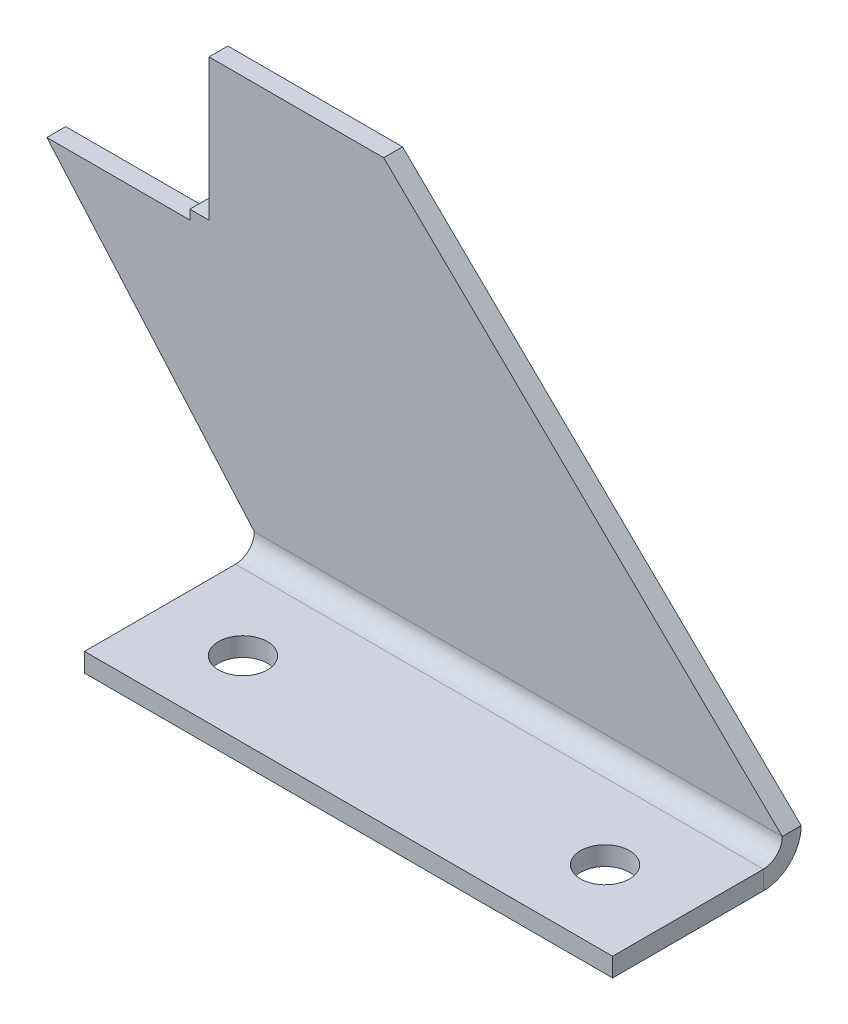
ISO-10303-21;
HEADER;
FILE_DESCRIPTION(('STEP AP214'),'2;1');
FILE_NAME('part.step','',(''),(''),'','','');
FILE_SCHEMA(('AUTOMOTIVE_DESIGN { 1 0 10303 214 1 1 1 1 }'));
ENDSEC;
DATA;
#1=APPLICATION_CONTEXT('core data for automotive mechanical design processes');
#2=APPLICATION_PROTOCOL_DEFINITION('international standard','automotive_design',2000,#1);
#3=PRODUCT_CONTEXT('',#1,'mechanical');
#4=PRODUCT('Part','Part','',(#3));
#5=PRODUCT_RELATED_PRODUCT_CATEGORY('part','',(#4));
#6=PRODUCT_DEFINITION_FORMATION('','',#4);
#7=PRODUCT_DEFINITION_CONTEXT('part definition',#1,'design');
#8=PRODUCT_DEFINITION('design','',#6,#7);
#9=PRODUCT_DEFINITION_SHAPE('','',#8);
#10=(LENGTH_UNIT() NAMED_UNIT(*) SI_UNIT(.MILLI.,.METRE.));
#11=(NAMED_UNIT(*) PLANE_ANGLE_UNIT() SI_UNIT($,.RADIAN.));
#12=(NAMED_UNIT(*) SI_UNIT($,.STERADIAN.) SOLID_ANGLE_UNIT());
#13=UNCERTAINTY_MEASURE_WITH_UNIT(LENGTH_MEASURE(1.E-05),#10,'distance_accuracy_value','');
#14=(GEOMETRIC_REPRESENTATION_CONTEXT(3) GLOBAL_UNCERTAINTY_ASSIGNED_CONTEXT((#13)) GLOBAL_UNIT_ASSIGNED_CONTEXT((#10,
#11,#12)) REPRESENTATION_CONTEXT('',''));
#15=CARTESIAN_POINT('',(0.,0.,0.));
#16=DIRECTION('',(0.,0.,1.));
#17=DIRECTION('',(1.,0.,0.));
#18=AXIS2_PLACEMENT_3D('',#15,#16,#17);
#19=CARTESIAN_POINT('',(-35.4637681159422,-31.5507246376835,-5.));
#20=DIRECTION('',(-1.,0.,0.));
#21=DIRECTION('',(0.,-1.,0.));
#22=AXIS2_PLACEMENT_3D('',#19,#20,#21);
#23=PLANE('',#22);
#24=DIRECTION('',(0.,-1.,0.));
#25=VECTOR('',#24,1.);
#26=CARTESIAN_POINT('',(-35.4637681159422,-31.5507246376835,0.));
#27=LINE('',#26,#25);
#28=CARTESIAN_POINT('',(-35.4637681159422,-29.0507246376835,0.));
#29=VERTEX_POINT('',#28);
#30=CARTESIAN_POINT('',(-35.4637681159422,-31.5507246376835,0.));
#31=VERTEX_POINT('',#30);
#32=EDGE_CURVE('E157',#29,#31,#27,.T.);
#33=ORIENTED_EDGE('',*,*,#32,.F.);
#34=DIRECTION('',(0.,0.,1.));
#35=VECTOR('',#34,1.);
#36=CARTESIAN_POINT('',(-35.4637681159422,-29.0507246376835,-5.));
#37=LINE('',#36,#35);
#38=CARTESIAN_POINT('',(-35.4637681159422,-29.0507246376835,-5.));
#39=VERTEX_POINT('',#38);
#40=EDGE_CURVE('E13',#39,#29,#37,.T.);
#41=ORIENTED_EDGE('',*,*,#40,.F.);
#42=DIRECTION('',(0.,-1.,0.));
#43=VECTOR('',#42,1.);
#44=CARTESIAN_POINT('',(-35.4637681159422,-31.5507246376835,-5.));
#45=LINE('',#44,#43);
#46=CARTESIAN_POINT('',(-35.4637681159422,-31.5507246376835,-5.));
#47=VERTEX_POINT('',#46);
#48=EDGE_CURVE('E178',#39,#47,#45,.T.);
#49=ORIENTED_EDGE('',*,*,#48,.T.);
#50=DIRECTION('',(0.,0.,1.));
#51=VECTOR('',#50,1.);
#52=CARTESIAN_POINT('',(-35.4637681159422,-31.5507246376835,-5.));
#53=LINE('',#52,#51);
#54=EDGE_CURVE('E62',#47,#31,#53,.T.);
#55=ORIENTED_EDGE('',*,*,#54,.T.);
#56=EDGE_LOOP('',(#33,#41,#49,#55));
#57=FACE_BOUND('',#56,.T.);
#58=ADVANCED_FACE('F59',(#57),#23,.T.);
#59=CARTESIAN_POINT('',(-30.3797448200958,-29.0507246376835,-5.));
#60=DIRECTION('',(0.,1.,0.));
#61=DIRECTION('',(-1.,0.,0.));
#62=AXIS2_PLACEMENT_3D('',#59,#60,#61);
#63=PLANE('',#62);
#64=DIRECTION('',(-1.,0.,0.));
#65=VECTOR('',#64,1.);
#66=CARTESIAN_POINT('',(-30.3797448200958,-29.0507246376835,0.));
#67=LINE('',#66,#65);
#68=CARTESIAN_POINT('',(-30.3797448200958,-29.0507246376835,0.));
#69=VERTEX_POINT('',#68);
#70=EDGE_CURVE('E176',#69,#29,#67,.T.);
#71=ORIENTED_EDGE('',*,*,#70,.F.);
#72=DIRECTION('',(0.,0.,1.));
#73=VECTOR('',#72,1.);
#74=CARTESIAN_POINT('',(-30.3797448200958,-29.0507246376835,-5.));
#75=LINE('',#74,#73);
#76=CARTESIAN_POINT('',(-30.3797448200958,-29.0507246376835,-5.));
#77=VERTEX_POINT('',#76);
#78=EDGE_CURVE('E68',#77,#69,#75,.T.);
#79=ORIENTED_EDGE('',*,*,#78,.F.);
#80=DIRECTION('',(-1.,0.,0.));
#81=VECTOR('',#80,1.);
#82=CARTESIAN_POINT('',(-30.3797448200958,-29.0507246376835,-5.));
#83=LINE('',#82,#81);
#84=EDGE_CURVE('E147',#77,#39,#83,.T.);
#85=ORIENTED_EDGE('',*,*,#84,.T.);
#86=ORIENTED_EDGE('',*,*,#40,.T.);
#87=EDGE_LOOP('',(#71,#79,#85,#86));
#88=FACE_BOUND('',#87,.T.);
#89=ADVANCED_FACE('F191',(#88),#63,.T.);
#90=CARTESIAN_POINT('',(-30.3797448200958,-29.0507246376835,-5.));
#91=DIRECTION('',(-1.,0.,0.));
#92=DIRECTION('',(0.,-1.,0.));
#93=AXIS2_PLACEMENT_3D('',#90,#91,#92);
#94=PLANE('',#93);
#95=DIRECTION('',(0.,-1.,0.));
#96=VECTOR('',#95,1.);
#97=CARTESIAN_POINT('',(-30.3797448200958,-29.0507246376835,0.));
#98=LINE('',#97,#96);
#99=CARTESIAN_POINT('',(-30.3797448200958,8.44927536231646,0.));
#100=VERTEX_POINT('',#99);
#101=EDGE_CURVE('E134',#100,#69,#98,.T.);
#102=ORIENTED_EDGE('',*,*,#101,.F.);
#103=DIRECTION('',(0.,0.,1.));
#104=VECTOR('',#103,1.);
#105=CARTESIAN_POINT('',(-30.3797448200958,8.44927536231646,-5.));
#106=LINE('',#105,#104);
#107=CARTESIAN_POINT('',(-30.3797448200958,8.44927536231646,-5.));
#108=VERTEX_POINT('',#107);
#109=EDGE_CURVE('E129',#108,#100,#106,.T.);
#110=ORIENTED_EDGE('',*,*,#109,.F.);
#111=DIRECTION('',(0.,-1.,0.));
#112=VECTOR('',#111,1.);
#113=CARTESIAN_POINT('',(-30.3797448200958,-29.0507246376835,-5.));
#114=LINE('',#113,#112);
#115=EDGE_CURVE('E132',#108,#77,#114,.T.);
#116=ORIENTED_EDGE('',*,*,#115,.T.);
#117=ORIENTED_EDGE('',*,*,#78,.T.);
#118=EDGE_LOOP('',(#102,#110,#116,#117));
#119=FACE_BOUND('',#118,.T.);
#120=ADVANCED_FACE('F131',(#119),#94,.T.);
#121=CARTESIAN_POINT('',(-30.3797448200958,8.44927536231646,-5.));
#122=DIRECTION('',(0.,1.,0.));
#123=DIRECTION('',(-1.,0.,0.));
#124=AXIS2_PLACEMENT_3D('',#121,#122,#123);
#125=PLANE('',#124);
#126=DIRECTION('',(-1.,0.,0.));
#127=VECTOR('',#126,1.);
#128=CARTESIAN_POINT('',(-30.3797448200958,8.44927536231646,0.));
#129=LINE('',#128,#127);
#130=CARTESIAN_POINT('',(15.9257985596365,8.44927536231649,0.));
#131=VERTEX_POINT('',#130);
#132=EDGE_CURVE('E173',#131,#100,#129,.T.);
#133=ORIENTED_EDGE('',*,*,#132,.F.);
#134=DIRECTION('',(0.,0.,1.));
#135=VECTOR('',#134,1.);
#136=CARTESIAN_POINT('',(15.9257985596365,8.44927536231649,-5.));
#137=LINE('',#136,#135);
#138=CARTESIAN_POINT('',(15.9257985596365,8.44927536231649,-5.));
#139=VERTEX_POINT('',#138);
#140=EDGE_CURVE('E139',#139,#131,#137,.T.);
#141=ORIENTED_EDGE('',*,*,#140,.F.);
#142=DIRECTION('',(-1.,0.,0.));
#143=VECTOR('',#142,1.);
#144=CARTESIAN_POINT('',(-30.3797448200958,8.44927536231646,-5.));
#145=LINE('',#144,#143);
#146=EDGE_CURVE('E145',#139,#108,#145,.T.);
#147=ORIENTED_EDGE('',*,*,#146,.T.);
#148=ORIENTED_EDGE('',*,*,#109,.T.);
#149=EDGE_LOOP('',(#133,#141,#147,#148));
#150=FACE_BOUND('',#149,.T.);
#151=ADVANCED_FACE('F149',(#150),#125,.T.);
#152=CARTESIAN_POINT('',(15.9257985596365,8.44927536231649,-5.));
#153=DIRECTION('',(0.697919149971632,0.716176556515832,0.));
#154=DIRECTION('',(-0.716176556515832,0.697919149971632,0.));
#155=AXIS2_PLACEMENT_3D('',#152,#153,#154);
#156=PLANE('',#155);
#157=DIRECTION('',(-0.716176556515832,0.697919149971632,0.));
#158=VECTOR('',#157,1.);
#159=CARTESIAN_POINT('',(15.9257985596365,8.44927536231649,0.));
#160=LINE('',#159,#158);
#161=CARTESIAN_POINT('',(121.620255179904,-94.5507246376835,0.));
#162=VERTEX_POINT('',#161);
#163=EDGE_CURVE('E170',#162,#131,#160,.T.);
#164=ORIENTED_EDGE('',*,*,#163,.F.);
#165=DIRECTION('',(0.,0.,1.));
#166=VECTOR('',#165,1.);
#167=CARTESIAN_POINT('',(121.620255179904,-94.5507246376835,-5.));
#168=LINE('',#167,#166);
#169=CARTESIAN_POINT('',(121.620255179904,-94.5507246376835,-4.99999999999998));
#170=VERTEX_POINT('',#169);
#171=EDGE_CURVE('E182',#170,#162,#168,.T.);
#172=ORIENTED_EDGE('',*,*,#171,.F.);
#173=DIRECTION('',(-0.716176556515832,0.697919149971632,0.));
#174=VECTOR('',#173,1.);
#175=CARTESIAN_POINT('',(15.9257985596365,8.44927536231649,-5.));
#176=LINE('',#175,#174);
#177=EDGE_CURVE('E150',#170,#139,#176,.T.);
#178=ORIENTED_EDGE('',*,*,#177,.T.);
#179=ORIENTED_EDGE('',*,*,#140,.T.);
#180=EDGE_LOOP('',(#164,#172,#178,#179));
#181=FACE_BOUND('',#180,.T.);
#182=ADVANCED_FACE('F204',(#181),#156,.T.);
#183=CARTESIAN_POINT('',(-73.3797448200958,-31.5507246376835,-5.));
#184=DIRECTION('',(-0.753316943211021,-0.657657648835018,0.));
#185=DIRECTION('',(0.657657648835018,-0.753316943211021,0.));
#186=AXIS2_PLACEMENT_3D('',#183,#184,#185);
#187=PLANE('',#186);
#188=DIRECTION('',(0.657657648835018,-0.753316943211021,0.));
#189=VECTOR('',#188,1.);
#190=CARTESIAN_POINT('',(-73.3797448200958,-31.5507246376835,0.));
#191=LINE('',#190,#189);
#192=CARTESIAN_POINT('',(-73.3797448200958,-31.5507246376835,0.));
#193=VERTEX_POINT('',#192);
#194=CARTESIAN_POINT('',(-18.3797448200958,-94.5507246376835,0.));
#195=VERTEX_POINT('',#194);
#196=EDGE_CURVE('E164',#193,#195,#191,.T.);
#197=ORIENTED_EDGE('',*,*,#196,.F.);
#198=DIRECTION('',(0.,0.,1.));
#199=VECTOR('',#198,1.);
#200=CARTESIAN_POINT('',(-73.3797448200958,-31.5507246376835,-5.));
#201=LINE('',#200,#199);
#202=CARTESIAN_POINT('',(-73.3797448200958,-31.5507246376835,-5.));
#203=VERTEX_POINT('',#202);
#204=EDGE_CURVE('E186',#203,#193,#201,.T.);
#205=ORIENTED_EDGE('',*,*,#204,.F.);
#206=DIRECTION('',(0.657657648835018,-0.753316943211021,0.));
#207=VECTOR('',#206,1.);
#208=CARTESIAN_POINT('',(-73.3797448200958,-31.5507246376835,-5.));
#209=LINE('',#208,#207);
#210=CARTESIAN_POINT('',(-18.3797448200958,-94.5507246376835,-5.));
#211=VERTEX_POINT('',#210);
#212=EDGE_CURVE('E327',#203,#211,#209,.T.);
#213=ORIENTED_EDGE('',*,*,#212,.T.);
#214=DIRECTION('',(0.,0.,1.));
#215=VECTOR('',#214,1.);
#216=CARTESIAN_POINT('',(-18.3797448200958,-94.5507246376835,-5.));
#217=LINE('',#216,#215);
#218=EDGE_CURVE('E185',#211,#195,#217,.T.);
#219=ORIENTED_EDGE('',*,*,#218,.T.);
#220=EDGE_LOOP('',(#197,#205,#213,#219));
#221=FACE_BOUND('',#220,.T.);
#222=ADVANCED_FACE('F207',(#221),#187,.T.);
#223=CARTESIAN_POINT('',(-35.4637681159422,-31.5507246376835,-5.));
#224=DIRECTION('',(0.,1.,0.));
#225=DIRECTION('',(0.,0.,1.));
#226=AXIS2_PLACEMENT_3D('',#223,#224,#225);
#227=PLANE('',#226);
#228=DIRECTION('',(-1.,0.,0.));
#229=VECTOR('',#228,1.);
#230=CARTESIAN_POINT('',(-35.4637681159422,-31.5507246376835,0.));
#231=LINE('',#230,#229);
#232=EDGE_CURVE('E160',#31,#193,#231,.T.);
#233=ORIENTED_EDGE('',*,*,#232,.F.);
#234=ORIENTED_EDGE('',*,*,#54,.F.);
#235=DIRECTION('',(-1.,0.,0.));
#236=VECTOR('',#235,1.);
#237=CARTESIAN_POINT('',(-35.4637681159422,-31.5507246376835,-5.));
#238=LINE('',#237,#236);
#239=EDGE_CURVE('E325',#47,#203,#238,.T.);
#240=ORIENTED_EDGE('',*,*,#239,.T.);
#241=ORIENTED_EDGE('',*,*,#204,.T.);
#242=EDGE_LOOP('',(#233,#234,#240,#241));
#243=FACE_BOUND('',#242,.T.);
#244=ADVANCED_FACE('F188',(#243),#227,.T.);
#245=CARTESIAN_POINT('',(0.,0.,-5.));
#246=DIRECTION('',(0.,0.,1.));
#247=DIRECTION('',(1.,0.,0.));
#248=AXIS2_PLACEMENT_3D('',#245,#246,#247);
#249=PLANE('',#248);
#250=ORIENTED_EDGE('',*,*,#48,.F.);
#251=ORIENTED_EDGE('',*,*,#84,.F.);
#252=ORIENTED_EDGE('',*,*,#115,.F.);
#253=ORIENTED_EDGE('',*,*,#146,.F.);
#254=ORIENTED_EDGE('',*,*,#177,.F.);
#255=DIRECTION('',(1.,0.,0.));
#256=VECTOR('',#255,1.);
#257=CARTESIAN_POINT('',(121.620255179904,-94.5507246376835,-5.));
#258=LINE('',#257,#256);
#259=EDGE_CURVE('E152',#211,#170,#258,.T.);
#260=ORIENTED_EDGE('',*,*,#259,.F.);
#261=ORIENTED_EDGE('',*,*,#212,.F.);
#262=ORIENTED_EDGE('',*,*,#239,.F.);
#263=EDGE_LOOP('',(#250,#251,#252,#253,#254,#260,#261,#262));
#264=FACE_BOUND('',#263,.T.);
#265=ADVANCED_FACE('F143',(#264),#249,.F.);
#266=CARTESIAN_POINT('',(0.,0.,0.));
#267=DIRECTION('',(0.,0.,1.));
#268=DIRECTION('',(1.,0.,0.));
#269=AXIS2_PLACEMENT_3D('',#266,#267,#268);
#270=PLANE('',#269);
#271=ORIENTED_EDGE('',*,*,#32,.T.);
#272=ORIENTED_EDGE('',*,*,#232,.T.);
#273=ORIENTED_EDGE('',*,*,#196,.T.);
#274=DIRECTION('',(1.,0.,0.));
#275=VECTOR('',#274,1.);
#276=CARTESIAN_POINT('',(121.620255179904,-94.5507246376835,0.));
#277=LINE('',#276,#275);
#278=EDGE_CURVE('E167',#195,#162,#277,.T.);
#279=ORIENTED_EDGE('',*,*,#278,.T.);
#280=ORIENTED_EDGE('',*,*,#163,.T.);
#281=ORIENTED_EDGE('',*,*,#132,.T.);
#282=ORIENTED_EDGE('',*,*,#101,.T.);
#283=ORIENTED_EDGE('',*,*,#70,.T.);
#284=EDGE_LOOP('',(#271,#272,#273,#279,#280,#281,#282,#283));
#285=FACE_BOUND('',#284,.T.);
#286=ADVANCED_FACE('F190',(#285),#270,.T.);
#287=CARTESIAN_POINT('',(-18.3797448200958,-94.5507246376835,5.));
#288=DIRECTION('',(-1.,0.,0.));
#289=DIRECTION('',(0.,0.,1.));
#290=AXIS2_PLACEMENT_3D('',#287,#288,#289);
#291=PLANE('',#290);
#292=DIRECTION('',(0.,1.,0.));
#293=VECTOR('',#292,1.);
#294=CARTESIAN_POINT('',(-18.3797448200958,-104.550724637684,4.99999999999996));
#295=LINE('',#294,#293);
#296=CARTESIAN_POINT('',(-18.3797448200958,-99.5507246376835,4.99999999999998));
#297=VERTEX_POINT('',#296);
#298=CARTESIAN_POINT('',(-18.3797448200958,-104.550724637684,4.99999999999996));
#299=VERTEX_POINT('',#298);
#300=EDGE_CURVE('E271',#297,#299,#295,.F.);
#301=ORIENTED_EDGE('',*,*,#300,.F.);
#302=CARTESIAN_POINT('',(-18.3797448200958,-94.5507246376835,5.));
#303=DIRECTION('',(1.,0.,0.));
#304=DIRECTION('',(0.,0.,-1.));
#305=AXIS2_PLACEMENT_3D('',#302,#303,#304);
#306=CIRCLE('',#305,4.99999999999999);
#307=EDGE_CURVE('E319',#195,#297,#306,.F.);
#308=ORIENTED_EDGE('',*,*,#307,.F.);
#309=ORIENTED_EDGE('',*,*,#218,.F.);
#310=CARTESIAN_POINT('',(-18.3797448200958,-94.5507246376835,5.));
#311=DIRECTION('',(1.,0.,0.));
#312=DIRECTION('',(0.,0.,-1.));
#313=AXIS2_PLACEMENT_3D('',#310,#311,#312);
#314=CIRCLE('',#313,9.99999999999999);
#315=EDGE_CURVE('E161',#211,#299,#314,.F.);
#316=ORIENTED_EDGE('',*,*,#315,.T.);
#317=EDGE_LOOP('',(#301,#308,#309,#316));
#318=FACE_BOUND('',#317,.T.);
#319=ADVANCED_FACE('F218',(#318),#291,.T.);
#320=CARTESIAN_POINT('',(121.620255179904,-94.5507246376835,5.00000000000001));
#321=DIRECTION('',(-1.,0.,0.));
#322=DIRECTION('',(0.,0.,1.));
#323=AXIS2_PLACEMENT_3D('',#320,#321,#322);
#324=PLANE('',#323);
#325=CARTESIAN_POINT('',(121.620255179904,-94.5507246376835,5.00000000000001));
#326=DIRECTION('',(1.,0.,0.));
#327=DIRECTION('',(0.,0.,-1.));
#328=AXIS2_PLACEMENT_3D('',#325,#326,#327);
#329=CIRCLE('',#328,4.99999999999999);
#330=CARTESIAN_POINT('',(121.620255179904,-99.5507246376835,4.99999999999999));
#331=VERTEX_POINT('',#330);
#332=EDGE_CURVE('E284',#331,#162,#329,.T.);
#333=ORIENTED_EDGE('',*,*,#332,.F.);
#334=DIRECTION('',(0.,1.,0.));
#335=VECTOR('',#334,1.);
#336=CARTESIAN_POINT('',(121.620255179904,-99.5507246376835,4.99999999999999));
#337=LINE('',#336,#335);
#338=CARTESIAN_POINT('',(121.620255179904,-104.550724637684,4.99999999999997));
#339=VERTEX_POINT('',#338);
#340=EDGE_CURVE('E309',#331,#339,#337,.F.);
#341=ORIENTED_EDGE('',*,*,#340,.T.);
#342=CARTESIAN_POINT('',(121.620255179904,-94.5507246376835,5.00000000000001));
#343=DIRECTION('',(1.,0.,0.));
#344=DIRECTION('',(0.,0.,-1.));
#345=AXIS2_PLACEMENT_3D('',#342,#343,#344);
#346=CIRCLE('',#345,9.99999999999999);
#347=EDGE_CURVE('E316',#339,#170,#346,.T.);
#348=ORIENTED_EDGE('',*,*,#347,.T.);
#349=ORIENTED_EDGE('',*,*,#171,.T.);
#350=EDGE_LOOP('',(#333,#341,#348,#349));
#351=FACE_BOUND('',#350,.T.);
#352=ADVANCED_FACE('F220',(#351),#324,.F.);
#353=CARTESIAN_POINT('',(121.620255179904,-94.5507246376835,5.00000000000001));
#354=DIRECTION('',(1.,0.,0.));
#355=DIRECTION('',(0.,-1.,0.));
#356=AXIS2_PLACEMENT_3D('',#353,#354,#355);
#357=CYLINDRICAL_SURFACE('',#356,9.99999999999999);
#358=ORIENTED_EDGE('',*,*,#259,.T.);
#359=ORIENTED_EDGE('',*,*,#347,.F.);
#360=DIRECTION('',(1.,0.,0.));
#361=VECTOR('',#360,1.);
#362=CARTESIAN_POINT('',(-18.3797448200958,-104.550724637684,4.99999999999996));
#363=LINE('',#362,#361);
#364=EDGE_CURVE('E306',#339,#299,#363,.F.);
#365=ORIENTED_EDGE('',*,*,#364,.T.);
#366=ORIENTED_EDGE('',*,*,#315,.F.);
#367=EDGE_LOOP('',(#358,#359,#365,#366));
#368=FACE_BOUND('',#367,.T.);
#369=ADVANCED_FACE('F223',(#368),#357,.T.);
#370=CARTESIAN_POINT('',(121.620255179904,-94.5507246376835,5.00000000000001));
#371=DIRECTION('',(1.,0.,0.));
#372=DIRECTION('',(0.,-1.,0.));
#373=AXIS2_PLACEMENT_3D('',#370,#371,#372);
#374=CYLINDRICAL_SURFACE('',#373,4.99999999999999);
#375=ORIENTED_EDGE('',*,*,#278,.F.);
#376=ORIENTED_EDGE('',*,*,#307,.T.);
#377=DIRECTION('',(1.,0.,0.));
#378=VECTOR('',#377,1.);
#379=CARTESIAN_POINT('',(-18.3797448200958,-99.5507246376835,4.99999999999998));
#380=LINE('',#379,#378);
#381=EDGE_CURVE('E275',#297,#331,#380,.T.);
#382=ORIENTED_EDGE('',*,*,#381,.T.);
#383=ORIENTED_EDGE('',*,*,#332,.T.);
#384=EDGE_LOOP('',(#375,#376,#382,#383));
#385=FACE_BOUND('',#384,.T.);
#386=ADVANCED_FACE('F228',(#385),#374,.F.);
#387=CARTESIAN_POINT('',(-18.3797448200958,-104.550724637684,0.));
#388=DIRECTION('',(1.,0.,0.));
#389=DIRECTION('',(0.,1.,0.));
#390=AXIS2_PLACEMENT_3D('',#387,#388,#389);
#391=PLANE('',#390);
#392=ORIENTED_EDGE('',*,*,#300,.T.);
#393=DIRECTION('',(0.,0.,-1.));
#394=VECTOR('',#393,1.);
#395=CARTESIAN_POINT('',(-18.3797448200958,-104.550724637684,-3.38206380684561E-13));
#396=LINE('',#395,#394);
#397=CARTESIAN_POINT('',(-18.3797448200958,-104.550724637684,45.));
#398=VERTEX_POINT('',#397);
#399=EDGE_CURVE('E294',#398,#299,#396,.T.);
#400=ORIENTED_EDGE('',*,*,#399,.F.);
#401=DIRECTION('',(0.,1.,0.));
#402=VECTOR('',#401,1.);
#403=CARTESIAN_POINT('',(-18.3797448200958,-104.550724637684,45.));
#404=LINE('',#403,#402);
#405=CARTESIAN_POINT('',(-18.3797448200958,-99.5507246376837,45.));
#406=VERTEX_POINT('',#405);
#407=EDGE_CURVE('E285',#398,#406,#404,.T.);
#408=ORIENTED_EDGE('',*,*,#407,.T.);
#409=DIRECTION('',(0.,0.,1.));
#410=VECTOR('',#409,1.);
#411=CARTESIAN_POINT('',(-18.3797448200958,-99.5507246376835,0.));
#412=LINE('',#411,#410);
#413=EDGE_CURVE('E303',#406,#297,#412,.F.);
#414=ORIENTED_EDGE('',*,*,#413,.T.);
#415=EDGE_LOOP('',(#392,#400,#408,#414));
#416=FACE_BOUND('',#415,.T.);
#417=ADVANCED_FACE('F231',(#416),#391,.F.);
#418=CARTESIAN_POINT('',(121.620255179904,-104.550724637684,45.));
#419=DIRECTION('',(-1.,0.,0.));
#420=DIRECTION('',(0.,-1.,0.));
#421=AXIS2_PLACEMENT_3D('',#418,#419,#420);
#422=PLANE('',#421);
#423=ORIENTED_EDGE('',*,*,#340,.F.);
#424=DIRECTION('',(0.,0.,-1.));
#425=VECTOR('',#424,1.);
#426=CARTESIAN_POINT('',(121.620255179904,-99.5507246376837,45.));
#427=LINE('',#426,#425);
#428=CARTESIAN_POINT('',(121.620255179904,-99.5507246376837,45.));
#429=VERTEX_POINT('',#428);
#430=EDGE_CURVE('E300',#331,#429,#427,.F.);
#431=ORIENTED_EDGE('',*,*,#430,.T.);
#432=DIRECTION('',(0.,1.,0.));
#433=VECTOR('',#432,1.);
#434=CARTESIAN_POINT('',(121.620255179904,-104.550724637684,45.));
#435=LINE('',#434,#433);
#436=CARTESIAN_POINT('',(121.620255179904,-104.550724637684,45.));
#437=VERTEX_POINT('',#436);
#438=EDGE_CURVE('E281',#437,#429,#435,.T.);
#439=ORIENTED_EDGE('',*,*,#438,.F.);
#440=DIRECTION('',(0.,0.,1.));
#441=VECTOR('',#440,1.);
#442=CARTESIAN_POINT('',(121.620255179904,-104.550724637684,-3.38206380684561E-13));
#443=LINE('',#442,#441);
#444=EDGE_CURVE('E291',#339,#437,#443,.T.);
#445=ORIENTED_EDGE('',*,*,#444,.F.);
#446=EDGE_LOOP('',(#423,#431,#439,#445));
#447=FACE_BOUND('',#446,.T.);
#448=ADVANCED_FACE('F238',(#447),#422,.F.);
#449=CARTESIAN_POINT('',(0.,-104.550724637684,-3.38206380684561E-13));
#450=DIRECTION('',(0.,1.,0.));
#451=DIRECTION('',(0.,0.,1.));
#452=AXIS2_PLACEMENT_3D('',#449,#450,#451);
#453=PLANE('',#452);
#454=CARTESIAN_POINT('',(3.62025517990417,-104.550724637684,25.));
#455=DIRECTION('',(0.,1.,0.));
#456=DIRECTION('',(0.,0.,1.));
#457=AXIS2_PLACEMENT_3D('',#454,#455,#456);
#458=CIRCLE('',#457,6.5);
#459=CARTESIAN_POINT('',(3.62025517990417,-104.550724637684,31.5));
#460=VERTEX_POINT('',#459);
#461=EDGE_CURVE('E270',#460,#460,#458,.T.);
#462=ORIENTED_EDGE('',*,*,#461,.T.);
#463=EDGE_LOOP('',(#462));
#464=FACE_BOUND('',#463,.T.);
#465=CARTESIAN_POINT('',(99.6202551799042,-104.550724637684,25.));
#466=DIRECTION('',(0.,1.,0.));
#467=DIRECTION('',(0.,0.,1.));
#468=AXIS2_PLACEMENT_3D('',#465,#466,#467);
#469=CIRCLE('',#468,6.50000000000006);
#470=CARTESIAN_POINT('',(99.6202551799042,-104.550724637684,31.5000000000001));
#471=VERTEX_POINT('',#470);
#472=EDGE_CURVE('E272',#471,#471,#469,.T.);
#473=ORIENTED_EDGE('',*,*,#472,.T.);
#474=EDGE_LOOP('',(#473));
#475=FACE_BOUND('',#474,.T.);
#476=ORIENTED_EDGE('',*,*,#364,.F.);
#477=ORIENTED_EDGE('',*,*,#444,.T.);
#478=DIRECTION('',(-1.,0.,0.));
#479=VECTOR('',#478,1.);
#480=CARTESIAN_POINT('',(0.,-104.550724637684,45.));
#481=LINE('',#480,#479);
#482=EDGE_CURVE('E288',#437,#398,#481,.T.);
#483=ORIENTED_EDGE('',*,*,#482,.T.);
#484=ORIENTED_EDGE('',*,*,#399,.T.);
#485=EDGE_LOOP('',(#476,#477,#483,#484));
#486=FACE_BOUND('',#485,.T.);
#487=ADVANCED_FACE('F242',(#464,#475,#486),#453,.F.);
#488=CARTESIAN_POINT('',(0.,-99.5507246376835,-3.20748973990345E-13));
#489=DIRECTION('',(0.,1.,0.));
#490=DIRECTION('',(0.,0.,1.));
#491=AXIS2_PLACEMENT_3D('',#488,#489,#490);
#492=PLANE('',#491);
#493=CARTESIAN_POINT('',(3.62025517990417,-99.5507246376836,25.));
#494=DIRECTION('',(0.,1.,0.));
#495=DIRECTION('',(0.,0.,1.));
#496=AXIS2_PLACEMENT_3D('',#493,#494,#495);
#497=CIRCLE('',#496,6.5);
#498=CARTESIAN_POINT('',(3.62025517990417,-99.5507246376836,31.5));
#499=VERTEX_POINT('',#498);
#500=EDGE_CURVE('E267',#499,#499,#497,.T.);
#501=ORIENTED_EDGE('',*,*,#500,.F.);
#502=EDGE_LOOP('',(#501));
#503=FACE_BOUND('',#502,.T.);
#504=CARTESIAN_POINT('',(99.6202551799042,-99.5507246376836,25.));
#505=DIRECTION('',(0.,1.,0.));
#506=DIRECTION('',(0.,0.,1.));
#507=AXIS2_PLACEMENT_3D('',#504,#505,#506);
#508=CIRCLE('',#507,6.50000000000006);
#509=CARTESIAN_POINT('',(99.6202551799042,-99.5507246376836,31.5000000000001));
#510=VERTEX_POINT('',#509);
#511=EDGE_CURVE('E366',#510,#510,#508,.T.);
#512=ORIENTED_EDGE('',*,*,#511,.F.);
#513=EDGE_LOOP('',(#512));
#514=FACE_BOUND('',#513,.T.);
#515=ORIENTED_EDGE('',*,*,#430,.F.);
#516=ORIENTED_EDGE('',*,*,#381,.F.);
#517=ORIENTED_EDGE('',*,*,#413,.F.);
#518=DIRECTION('',(1.,0.,0.));
#519=VECTOR('',#518,1.);
#520=CARTESIAN_POINT('',(-18.3797448200958,-99.5507246376837,45.));
#521=LINE('',#520,#519);
#522=EDGE_CURVE('E297',#429,#406,#521,.F.);
#523=ORIENTED_EDGE('',*,*,#522,.F.);
#524=EDGE_LOOP('',(#515,#516,#517,#523));
#525=FACE_BOUND('',#524,.T.);
#526=ADVANCED_FACE('F248',(#503,#514,#525),#492,.T.);
#527=CARTESIAN_POINT('',(-18.3797448200958,-104.550724637684,45.));
#528=DIRECTION('',(0.,0.,-1.));
#529=DIRECTION('',(0.,1.,0.));
#530=AXIS2_PLACEMENT_3D('',#527,#528,#529);
#531=PLANE('',#530);
#532=ORIENTED_EDGE('',*,*,#522,.T.);
#533=ORIENTED_EDGE('',*,*,#407,.F.);
#534=ORIENTED_EDGE('',*,*,#482,.F.);
#535=ORIENTED_EDGE('',*,*,#438,.T.);
#536=EDGE_LOOP('',(#532,#533,#534,#535));
#537=FACE_BOUND('',#536,.T.);
#538=ADVANCED_FACE('F244',(#537),#531,.F.);
#539=CARTESIAN_POINT('',(99.6202551799042,-109.550724637684,25.));
#540=DIRECTION('',(0.,1.,0.));
#541=DIRECTION('',(0.,0.,1.));
#542=AXIS2_PLACEMENT_3D('',#539,#540,#541);
#543=CYLINDRICAL_SURFACE('',#542,6.50000000000006);
#544=ORIENTED_EDGE('',*,*,#511,.T.);
#545=EDGE_LOOP('',(#544));
#546=FACE_BOUND('',#545,.T.);
#547=ORIENTED_EDGE('',*,*,#472,.F.);
#548=EDGE_LOOP('',(#547));
#549=FACE_BOUND('',#548,.T.);
#550=ADVANCED_FACE('F247',(#546,#549),#543,.F.);
#551=CARTESIAN_POINT('',(3.62025517990418,-109.550724637684,25.));
#552=DIRECTION('',(0.,1.,0.));
#553=DIRECTION('',(0.,0.,1.));
#554=AXIS2_PLACEMENT_3D('',#551,#552,#553);
#555=CYLINDRICAL_SURFACE('',#554,6.5);
#556=ORIENTED_EDGE('',*,*,#500,.T.);
#557=EDGE_LOOP('',(#556));
#558=FACE_BOUND('',#557,.T.);
#559=ORIENTED_EDGE('',*,*,#461,.F.);
#560=EDGE_LOOP('',(#559));
#561=FACE_BOUND('',#560,.T.);
#562=ADVANCED_FACE('F258',(#558,#561),#555,.F.);
#563=CLOSED_SHELL('',(#58,#89,#120,#151,#182,#222,#244,#265,#286,#319,#352,#369,#386,#417,#448,
#487,#526,#538,#550,#562));
#564=MANIFOLD_SOLID_BREP('B2',#563);
#565=ADVANCED_BREP_SHAPE_REPRESENTATION('',(#18,#564),#14);
#566=SHAPE_DEFINITION_REPRESENTATION(#9,#565);
ENDSEC;
END-ISO-10303-21;
